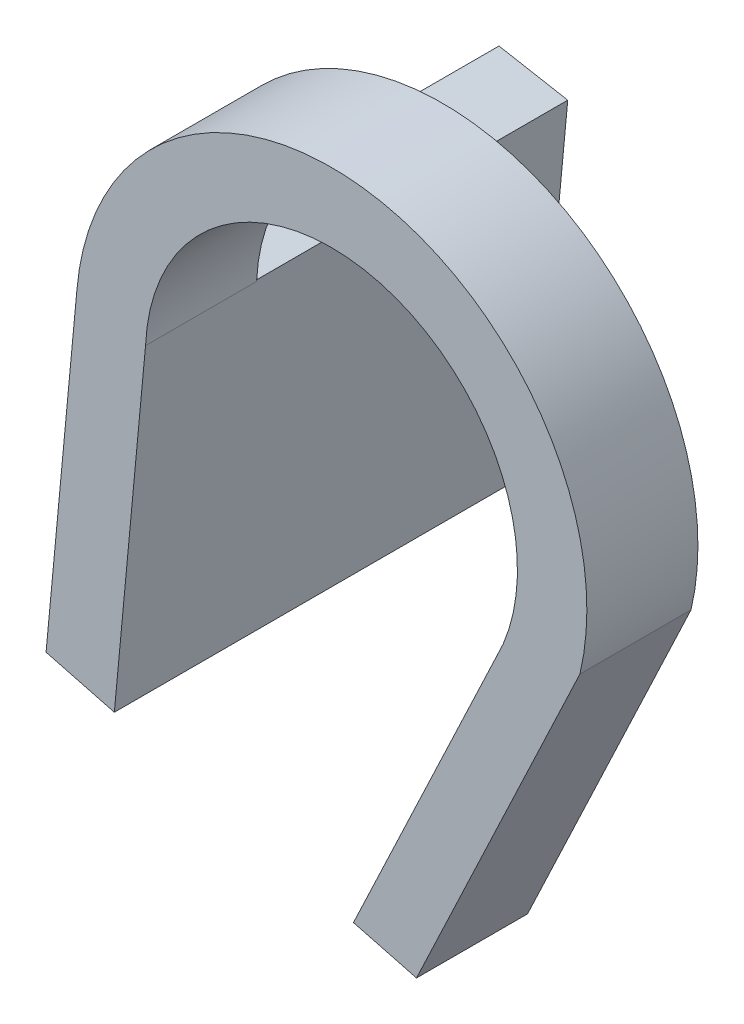
ISO-10303-21;
HEADER;
FILE_DESCRIPTION(('STEP AP214'),'2;1');
FILE_NAME('part.step','',(''),(''),'','','');
FILE_SCHEMA(('AUTOMOTIVE_DESIGN { 1 0 10303 214 1 1 1 1 }'));
ENDSEC;
DATA;
#1=APPLICATION_CONTEXT('core data for automotive mechanical design processes');
#2=APPLICATION_PROTOCOL_DEFINITION('international standard','automotive_design',2000,#1);
#3=PRODUCT_CONTEXT('',#1,'mechanical');
#4=PRODUCT('Part','Part','',(#3));
#5=PRODUCT_RELATED_PRODUCT_CATEGORY('part','',(#4));
#6=PRODUCT_DEFINITION_FORMATION('','',#4);
#7=PRODUCT_DEFINITION_CONTEXT('part definition',#1,'design');
#8=PRODUCT_DEFINITION('design','',#6,#7);
#9=PRODUCT_DEFINITION_SHAPE('','',#8);
#10=(LENGTH_UNIT() NAMED_UNIT(*) SI_UNIT(.MILLI.,.METRE.));
#11=(NAMED_UNIT(*) PLANE_ANGLE_UNIT() SI_UNIT($,.RADIAN.));
#12=(NAMED_UNIT(*) SI_UNIT($,.STERADIAN.) SOLID_ANGLE_UNIT());
#13=UNCERTAINTY_MEASURE_WITH_UNIT(LENGTH_MEASURE(1.E-05),#10,'distance_accuracy_value','');
#14=(GEOMETRIC_REPRESENTATION_CONTEXT(3) GLOBAL_UNCERTAINTY_ASSIGNED_CONTEXT((#13)) GLOBAL_UNIT_ASSIGNED_CONTEXT((#10,
#11,#12)) REPRESENTATION_CONTEXT('',''));
#15=CARTESIAN_POINT('',(0.,0.,0.));
#16=DIRECTION('',(0.,0.,1.));
#17=DIRECTION('',(1.,0.,0.));
#18=AXIS2_PLACEMENT_3D('',#15,#16,#17);
#19=CARTESIAN_POINT('',(0.,0.,0.));
#20=DIRECTION('',(0.,0.,1.));
#21=DIRECTION('',(1.,0.,0.));
#22=AXIS2_PLACEMENT_3D('',#19,#20,#21);
#23=PLANE('',#22);
#24=DIRECTION('',(0.983858981174969,-0.178945536857871,0.));
#25=VECTOR('',#24,1.);
#26=CARTESIAN_POINT('',(-22.9126775409918,2.0023006523836,0.));
#27=LINE('',#26,#25);
#28=CARTESIAN_POINT('',(-22.9126775409917,2.00230065238358,0.));
#29=VERTEX_POINT('',#28);
#30=CARTESIAN_POINT('',(-16.727012378482,0.877243917112009,0.));
#31=VERTEX_POINT('',#30);
#32=EDGE_CURVE('E84',#29,#31,#27,.T.);
#33=ORIENTED_EDGE('',*,*,#32,.F.);
#34=CARTESIAN_POINT('',(0.,0.,0.));
#35=DIRECTION('',(0.,0.,1.));
#36=DIRECTION('',(1.,0.,0.));
#37=AXIS2_PLACEMENT_3D('',#34,#35,#36);
#38=CIRCLE('',#37,23.);
#39=CARTESIAN_POINT('',(22.3756679030679,-5.32254505773474,0.));
#40=VERTEX_POINT('',#39);
#41=EDGE_CURVE('E120',#40,#29,#38,.T.);
#42=ORIENTED_EDGE('',*,*,#41,.F.);
#43=DIRECTION('',(0.428159671060033,0.903703101730742,0.));
#44=VECTOR('',#43,1.);
#45=CARTESIAN_POINT('',(20.3331929347107,-9.63353249740182,0.));
#46=LINE('',#45,#44);
#47=CARTESIAN_POINT('',(7.66040297450016,-36.3815902167818,0.));
#48=VERTEX_POINT('',#47);
#49=EDGE_CURVE('E76',#48,#40,#46,.T.);
#50=ORIENTED_EDGE('',*,*,#49,.F.);
#51=DIRECTION('',(0.967447305437016,-0.253072541384199,0.));
#52=VECTOR('',#51,1.);
#53=CARTESIAN_POINT('',(-8.41684697214123,-32.1759756271297,0.));
#54=LINE('',#53,#52);
#55=CARTESIAN_POINT('',(1.98558972977327,-34.8971275471845,0.));
#56=VERTEX_POINT('',#55);
#57=EDGE_CURVE('E156',#56,#48,#54,.T.);
#58=ORIENTED_EDGE('',*,*,#57,.F.);
#59=DIRECTION('',(0.428159671060033,0.903703101730742,0.));
#60=VECTOR('',#59,1.);
#61=CARTESIAN_POINT('',(15.1243084616516,-7.16564867770105,0.));
#62=LINE('',#61,#60);
#63=CARTESIAN_POINT('',(14.8303798615743,-7.78603449526219,0.));
#64=VERTEX_POINT('',#63);
#65=EDGE_CURVE('E138',#56,#64,#62,.T.);
#66=ORIENTED_EDGE('',*,*,#65,.T.);
#67=CARTESIAN_POINT('',(0.,0.,0.));
#68=DIRECTION('',(0.,0.,1.));
#69=DIRECTION('',(1.,0.,0.));
#70=AXIS2_PLACEMENT_3D('',#67,#68,#69);
#71=CIRCLE('',#70,16.75);
#72=EDGE_CURVE('E135',#64,#31,#71,.T.);
#73=ORIENTED_EDGE('',*,*,#72,.T.);
#74=EDGE_LOOP('',(#33,#42,#50,#58,#66,#73));
#75=FACE_BOUND('',#74,.T.);
#76=ADVANCED_FACE('F35',(#75),#23,.F.);
#77=CARTESIAN_POINT('',(-16.6565711575949,1.56008715798542,10.));
#78=DIRECTION('',(0.995642368139939,-0.0932538190354416,0.));
#79=DIRECTION('',(0.0932538190354416,0.995642368139939,0.));
#80=AXIS2_PLACEMENT_3D('',#77,#78,#79);
#81=PLANE('',#80);
#82=DIRECTION('',(0.,0.,-1.));
#83=VECTOR('',#82,1.);
#84=CARTESIAN_POINT('',(-19.5437388438165,-29.2653149763152,10.));
#85=LINE('',#84,#83);
#86=CARTESIAN_POINT('',(-19.5437388438165,-29.2653149763152,10.));
#87=VERTEX_POINT('',#86);
#88=CARTESIAN_POINT('',(-19.5437388438165,-29.2653149763152,-28.));
#89=VERTEX_POINT('',#88);
#90=EDGE_CURVE('E131',#87,#89,#85,.T.);
#91=ORIENTED_EDGE('',*,*,#90,.T.);
#92=DIRECTION('',(-0.0932538190354415,-0.995642368139939,0.));
#93=VECTOR('',#92,1.);
#94=CARTESIAN_POINT('',(-16.7206362164291,0.876084212557304,-28.));
#95=LINE('',#94,#93);
#96=CARTESIAN_POINT('',(-16.7206362164291,0.876084212557304,-28.));
#97=VERTEX_POINT('',#96);
#98=EDGE_CURVE('E345',#97,#89,#95,.T.);
#99=ORIENTED_EDGE('',*,*,#98,.F.);
#100=DIRECTION('',(0.,0.,1.));
#101=VECTOR('',#100,1.);
#102=CARTESIAN_POINT('',(-16.7206362164291,0.876084212557304,-28.));
#103=LINE('',#102,#101);
#104=CARTESIAN_POINT('',(-16.7206362164291,0.876084212557304,0.));
#105=VERTEX_POINT('',#104);
#106=EDGE_CURVE('E197',#97,#105,#103,.T.);
#107=ORIENTED_EDGE('',*,*,#106,.T.);
#108=DIRECTION('',(-0.0932538190354415,-0.995642368139939,0.));
#109=VECTOR('',#108,1.);
#110=CARTESIAN_POINT('',(-16.7206362164291,0.876084212557304,0.));
#111=LINE('',#110,#109);
#112=CARTESIAN_POINT('',(-16.7338799420808,0.734685023684826,0.));
#113=VERTEX_POINT('',#112);
#114=EDGE_CURVE('E182',#105,#113,#111,.T.);
#115=ORIENTED_EDGE('',*,*,#114,.T.);
#116=DIRECTION('',(0.,0.,-1.));
#117=VECTOR('',#116,1.);
#118=CARTESIAN_POINT('',(-16.7338799420808,0.734685023684826,10.));
#119=LINE('',#118,#117);
#120=CARTESIAN_POINT('',(-16.7338799420808,0.734685023684826,10.));
#121=VERTEX_POINT('',#120);
#122=EDGE_CURVE('E11',#121,#113,#119,.T.);
#123=ORIENTED_EDGE('',*,*,#122,.F.);
#124=DIRECTION('',(-0.0932538190354416,-0.995642368139939,0.));
#125=VECTOR('',#124,1.);
#126=CARTESIAN_POINT('',(-16.6565711575949,1.56008715798542,10.));
#127=LINE('',#126,#125);
#128=EDGE_CURVE('E155',#121,#87,#127,.T.);
#129=ORIENTED_EDGE('',*,*,#128,.T.);
#130=EDGE_LOOP('',(#91,#99,#107,#115,#123,#129));
#131=FACE_BOUND('',#130,.T.);
#132=ADVANCED_FACE('F37',(#131),#81,.T.);
#133=CARTESIAN_POINT('',(0.,0.,10.));
#134=DIRECTION('',(0.,0.,-1.));
#135=DIRECTION('',(-1.,0.,0.));
#136=AXIS2_PLACEMENT_3D('',#133,#134,#135);
#137=CYLINDRICAL_SURFACE('',#136,16.75);
#138=ORIENTED_EDGE('',*,*,#72,.F.);
#139=DIRECTION('',(0.,0.,-1.));
#140=VECTOR('',#139,1.);
#141=CARTESIAN_POINT('',(14.8303798615743,-7.78603449526219,10.));
#142=LINE('',#141,#140);
#143=CARTESIAN_POINT('',(14.8303798615743,-7.78603449526219,10.));
#144=VERTEX_POINT('',#143);
#145=EDGE_CURVE('E45',#144,#64,#142,.T.);
#146=ORIENTED_EDGE('',*,*,#145,.F.);
#147=CARTESIAN_POINT('',(0.,0.,10.));
#148=DIRECTION('',(0.,0.,1.));
#149=DIRECTION('',(1.,0.,0.));
#150=AXIS2_PLACEMENT_3D('',#147,#148,#149);
#151=CIRCLE('',#150,16.75);
#152=EDGE_CURVE('E201',#144,#121,#151,.T.);
#153=ORIENTED_EDGE('',*,*,#152,.T.);
#154=ORIENTED_EDGE('',*,*,#122,.T.);
#155=EDGE_CURVE('E139',#31,#113,#71,.T.);
#156=ORIENTED_EDGE('',*,*,#155,.F.);
#157=EDGE_LOOP('',(#138,#146,#153,#154,#156));
#158=FACE_BOUND('',#157,.T.);
#159=ADVANCED_FACE('F173',(#158),#137,.F.);
#160=CARTESIAN_POINT('',(15.1243084616516,-7.16564867770105,10.));
#161=DIRECTION('',(-0.903703101730742,0.428159671060033,0.));
#162=DIRECTION('',(-0.428159671060033,-0.903703101730742,0.));
#163=AXIS2_PLACEMENT_3D('',#160,#161,#162);
#164=PLANE('',#163);
#165=ORIENTED_EDGE('',*,*,#65,.F.);
#166=DIRECTION('',(0.,0.,-1.));
#167=VECTOR('',#166,1.);
#168=CARTESIAN_POINT('',(1.98558972977327,-34.8971275471845,10.));
#169=LINE('',#168,#167);
#170=CARTESIAN_POINT('',(1.98558972977327,-34.8971275471845,10.));
#171=VERTEX_POINT('',#170);
#172=EDGE_CURVE('E146',#171,#56,#169,.T.);
#173=ORIENTED_EDGE('',*,*,#172,.F.);
#174=DIRECTION('',(0.428159671060033,0.903703101730742,0.));
#175=VECTOR('',#174,1.);
#176=CARTESIAN_POINT('',(15.1243084616516,-7.16564867770105,10.));
#177=LINE('',#176,#175);
#178=EDGE_CURVE('E169',#171,#144,#177,.T.);
#179=ORIENTED_EDGE('',*,*,#178,.T.);
#180=ORIENTED_EDGE('',*,*,#145,.T.);
#181=EDGE_LOOP('',(#165,#173,#179,#180));
#182=FACE_BOUND('',#181,.T.);
#183=ADVANCED_FACE('F165',(#182),#164,.T.);
#184=CARTESIAN_POINT('',(-8.41684697214123,-32.1759756271297,10.));
#185=DIRECTION('',(0.253072541384199,0.967447305437016,0.));
#186=DIRECTION('',(-0.967447305437016,0.253072541384199,0.));
#187=AXIS2_PLACEMENT_3D('',#184,#185,#186);
#188=PLANE('',#187);
#189=ORIENTED_EDGE('',*,*,#57,.T.);
#190=DIRECTION('',(0.,0.,-1.));
#191=VECTOR('',#190,1.);
#192=CARTESIAN_POINT('',(7.66040297450016,-36.3815902167818,10.));
#193=LINE('',#192,#191);
#194=CARTESIAN_POINT('',(7.66040297450016,-36.3815902167818,10.));
#195=VERTEX_POINT('',#194);
#196=EDGE_CURVE('E148',#195,#48,#193,.T.);
#197=ORIENTED_EDGE('',*,*,#196,.F.);
#198=DIRECTION('',(0.967447305437016,-0.253072541384199,0.));
#199=VECTOR('',#198,1.);
#200=CARTESIAN_POINT('',(-8.41684697214123,-32.1759756271297,10.));
#201=LINE('',#200,#199);
#202=EDGE_CURVE('E204',#171,#195,#201,.T.);
#203=ORIENTED_EDGE('',*,*,#202,.F.);
#204=ORIENTED_EDGE('',*,*,#172,.T.);
#205=EDGE_LOOP('',(#189,#197,#203,#204));
#206=FACE_BOUND('',#205,.T.);
#207=ADVANCED_FACE('F205',(#206),#188,.F.);
#208=CARTESIAN_POINT('',(20.3331929347107,-9.63353249740182,10.));
#209=DIRECTION('',(-0.903703101730742,0.428159671060033,0.));
#210=DIRECTION('',(-0.428159671060033,-0.903703101730742,0.));
#211=AXIS2_PLACEMENT_3D('',#208,#209,#210);
#212=PLANE('',#211);
#213=ORIENTED_EDGE('',*,*,#49,.T.);
#214=DIRECTION('',(0.,0.,-1.));
#215=VECTOR('',#214,1.);
#216=CARTESIAN_POINT('',(22.3756679030679,-5.32254505773474,10.));
#217=LINE('',#216,#215);
#218=CARTESIAN_POINT('',(22.3756679030679,-5.32254505773474,10.));
#219=VERTEX_POINT('',#218);
#220=EDGE_CURVE('E124',#219,#40,#217,.T.);
#221=ORIENTED_EDGE('',*,*,#220,.F.);
#222=DIRECTION('',(0.428159671060033,0.903703101730742,0.));
#223=VECTOR('',#222,1.);
#224=CARTESIAN_POINT('',(20.3331929347107,-9.63353249740182,10.));
#225=LINE('',#224,#223);
#226=EDGE_CURVE('E114',#195,#219,#225,.T.);
#227=ORIENTED_EDGE('',*,*,#226,.F.);
#228=ORIENTED_EDGE('',*,*,#196,.T.);
#229=EDGE_LOOP('',(#213,#221,#227,#228));
#230=FACE_BOUND('',#229,.T.);
#231=ADVANCED_FACE('F206',(#230),#212,.F.);
#232=CARTESIAN_POINT('',(0.,0.,10.));
#233=DIRECTION('',(0.,0.,-1.));
#234=DIRECTION('',(-1.,0.,0.));
#235=AXIS2_PLACEMENT_3D('',#232,#233,#234);
#236=CYLINDRICAL_SURFACE('',#235,23.);
#237=ORIENTED_EDGE('',*,*,#41,.T.);
#238=DIRECTION('',(0.,0.,-1.));
#239=VECTOR('',#238,1.);
#240=CARTESIAN_POINT('',(-22.9126775409917,2.00230065238358,10.));
#241=LINE('',#240,#239);
#242=CARTESIAN_POINT('',(-22.9126775409917,2.00230065238358,10.));
#243=VERTEX_POINT('',#242);
#244=EDGE_CURVE('E118',#243,#29,#241,.T.);
#245=ORIENTED_EDGE('',*,*,#244,.F.);
#246=CARTESIAN_POINT('',(0.,0.,10.));
#247=DIRECTION('',(0.,0.,1.));
#248=DIRECTION('',(1.,0.,0.));
#249=AXIS2_PLACEMENT_3D('',#246,#247,#248);
#250=CIRCLE('',#249,23.);
#251=EDGE_CURVE('E107',#219,#243,#250,.T.);
#252=ORIENTED_EDGE('',*,*,#251,.F.);
#253=ORIENTED_EDGE('',*,*,#220,.T.);
#254=EDGE_LOOP('',(#237,#245,#252,#253));
#255=FACE_BOUND('',#254,.T.);
#256=ADVANCED_FACE('F119',(#255),#236,.T.);
#257=CARTESIAN_POINT('',(-22.89933111766,2.14479631282503,10.));
#258=DIRECTION('',(0.995642368139939,-0.0932538190354416,0.));
#259=DIRECTION('',(0.0932538190354416,0.995642368139939,0.));
#260=AXIS2_PLACEMENT_3D('',#257,#258,#259);
#261=PLANE('',#260);
#262=ORIENTED_EDGE('',*,*,#244,.T.);
#263=DIRECTION('',(0.,0.,1.));
#264=VECTOR('',#263,1.);
#265=CARTESIAN_POINT('',(-22.9126775409918,2.0023006523836,-28.));
#266=LINE('',#265,#264);
#267=CARTESIAN_POINT('',(-22.9126775409918,2.0023006523836,-28.));
#268=VERTEX_POINT('',#267);
#269=EDGE_CURVE('E144',#268,#29,#266,.T.);
#270=ORIENTED_EDGE('',*,*,#269,.F.);
#271=DIRECTION('',(0.0932538190354348,0.995642368139939,0.));
#272=VECTOR('',#271,1.);
#273=CARTESIAN_POINT('',(-25.6906591049102,-27.6573548079231,-28.));
#274=LINE('',#273,#272);
#275=CARTESIAN_POINT('',(-25.6906591049102,-27.6573548079231,-28.));
#276=VERTEX_POINT('',#275);
#277=EDGE_CURVE('E189',#276,#268,#274,.T.);
#278=ORIENTED_EDGE('',*,*,#277,.F.);
#279=DIRECTION('',(0.,0.,-1.));
#280=VECTOR('',#279,1.);
#281=CARTESIAN_POINT('',(-25.6906591049102,-27.657354807923,10.));
#282=LINE('',#281,#280);
#283=CARTESIAN_POINT('',(-25.6906591049102,-27.657354807923,10.));
#284=VERTEX_POINT('',#283);
#285=EDGE_CURVE('E125',#284,#276,#282,.T.);
#286=ORIENTED_EDGE('',*,*,#285,.F.);
#287=DIRECTION('',(-0.0932538190354416,-0.995642368139939,0.));
#288=VECTOR('',#287,1.);
#289=CARTESIAN_POINT('',(-22.89933111766,2.14479631282503,10.));
#290=LINE('',#289,#288);
#291=EDGE_CURVE('E111',#243,#284,#290,.T.);
#292=ORIENTED_EDGE('',*,*,#291,.F.);
#293=EDGE_LOOP('',(#262,#270,#278,#286,#292));
#294=FACE_BOUND('',#293,.T.);
#295=ADVANCED_FACE('F127',(#294),#261,.F.);
#296=CARTESIAN_POINT('',(-8.41684697214123,-32.1759756271297,10.));
#297=DIRECTION('',(0.253072541384199,0.967447305437016,0.));
#298=DIRECTION('',(-0.967447305437016,0.253072541384199,0.));
#299=AXIS2_PLACEMENT_3D('',#296,#297,#298);
#300=PLANE('',#299);
#301=ORIENTED_EDGE('',*,*,#285,.T.);
#302=DIRECTION('',(-0.967447305437016,0.253072541384198,0.));
#303=VECTOR('',#302,1.);
#304=CARTESIAN_POINT('',(-19.5437388438165,-29.2653149763152,-28.));
#305=LINE('',#304,#303);
#306=EDGE_CURVE('E193',#89,#276,#305,.T.);
#307=ORIENTED_EDGE('',*,*,#306,.F.);
#308=ORIENTED_EDGE('',*,*,#90,.F.);
#309=DIRECTION('',(0.967447305437016,-0.253072541384199,0.));
#310=VECTOR('',#309,1.);
#311=CARTESIAN_POINT('',(-8.41684697214123,-32.1759756271297,10.));
#312=LINE('',#311,#310);
#313=EDGE_CURVE('E53',#284,#87,#312,.T.);
#314=ORIENTED_EDGE('',*,*,#313,.F.);
#315=EDGE_LOOP('',(#301,#307,#308,#314));
#316=FACE_BOUND('',#315,.T.);
#317=ADVANCED_FACE('F223',(#316),#300,.F.);
#318=CARTESIAN_POINT('',(0.,0.,10.));
#319=DIRECTION('',(0.,0.,1.));
#320=DIRECTION('',(1.,0.,0.));
#321=AXIS2_PLACEMENT_3D('',#318,#319,#320);
#322=PLANE('',#321);
#323=ORIENTED_EDGE('',*,*,#128,.F.);
#324=ORIENTED_EDGE('',*,*,#152,.F.);
#325=ORIENTED_EDGE('',*,*,#178,.F.);
#326=ORIENTED_EDGE('',*,*,#202,.T.);
#327=ORIENTED_EDGE('',*,*,#226,.T.);
#328=ORIENTED_EDGE('',*,*,#251,.T.);
#329=ORIENTED_EDGE('',*,*,#291,.T.);
#330=ORIENTED_EDGE('',*,*,#313,.T.);
#331=EDGE_LOOP('',(#323,#324,#325,#326,#327,#328,#329,#330));
#332=FACE_BOUND('',#331,.T.);
#333=ADVANCED_FACE('F109',(#332),#322,.T.);
#334=CARTESIAN_POINT('',(0.,0.,0.));
#335=DIRECTION('',(0.,0.,-1.));
#336=DIRECTION('',(-1.,0.,0.));
#337=AXIS2_PLACEMENT_3D('',#334,#335,#336);
#338=PLANE('',#337);
#339=EDGE_CURVE('E179',#31,#105,#27,.T.);
#340=ORIENTED_EDGE('',*,*,#339,.F.);
#341=ORIENTED_EDGE('',*,*,#155,.T.);
#342=ORIENTED_EDGE('',*,*,#114,.F.);
#343=EDGE_LOOP('',(#340,#341,#342));
#344=FACE_BOUND('',#343,.T.);
#345=ADVANCED_FACE('F180',(#344),#338,.F.);
#346=CARTESIAN_POINT('',(-22.9126775409918,2.0023006523836,-28.));
#347=DIRECTION('',(-0.178945536857871,-0.983858981174969,0.));
#348=DIRECTION('',(0.983858981174969,-0.178945536857871,0.));
#349=AXIS2_PLACEMENT_3D('',#346,#347,#348);
#350=PLANE('',#349);
#351=ORIENTED_EDGE('',*,*,#32,.T.);
#352=ORIENTED_EDGE('',*,*,#339,.T.);
#353=ORIENTED_EDGE('',*,*,#106,.F.);
#354=DIRECTION('',(0.983858981174969,-0.178945536857871,0.));
#355=VECTOR('',#354,1.);
#356=CARTESIAN_POINT('',(-22.9126775409918,2.0023006523836,-28.));
#357=LINE('',#356,#355);
#358=EDGE_CURVE('E340',#268,#97,#357,.T.);
#359=ORIENTED_EDGE('',*,*,#358,.F.);
#360=ORIENTED_EDGE('',*,*,#269,.T.);
#361=EDGE_LOOP('',(#351,#352,#353,#359,#360));
#362=FACE_BOUND('',#361,.T.);
#363=ADVANCED_FACE('F187',(#362),#350,.F.);
#364=CARTESIAN_POINT('',(0.,0.,-28.));
#365=DIRECTION('',(0.,0.,-1.));
#366=DIRECTION('',(-1.,0.,0.));
#367=AXIS2_PLACEMENT_3D('',#364,#365,#366);
#368=PLANE('',#367);
#369=ORIENTED_EDGE('',*,*,#277,.T.);
#370=ORIENTED_EDGE('',*,*,#358,.T.);
#371=ORIENTED_EDGE('',*,*,#98,.T.);
#372=ORIENTED_EDGE('',*,*,#306,.T.);
#373=EDGE_LOOP('',(#369,#370,#371,#372));
#374=FACE_BOUND('',#373,.T.);
#375=ADVANCED_FACE('F253',(#374),#368,.T.);
#376=CLOSED_SHELL('',(#76,#132,#159,#183,#207,#231,#256,#295,#317,#333,#345,#363,#375));
#377=MANIFOLD_SOLID_BREP('B2',#376);
#378=ADVANCED_BREP_SHAPE_REPRESENTATION('',(#18,#377),#14);
#379=SHAPE_DEFINITION_REPRESENTATION(#9,#378);
ENDSEC;
END-ISO-10303-21;
